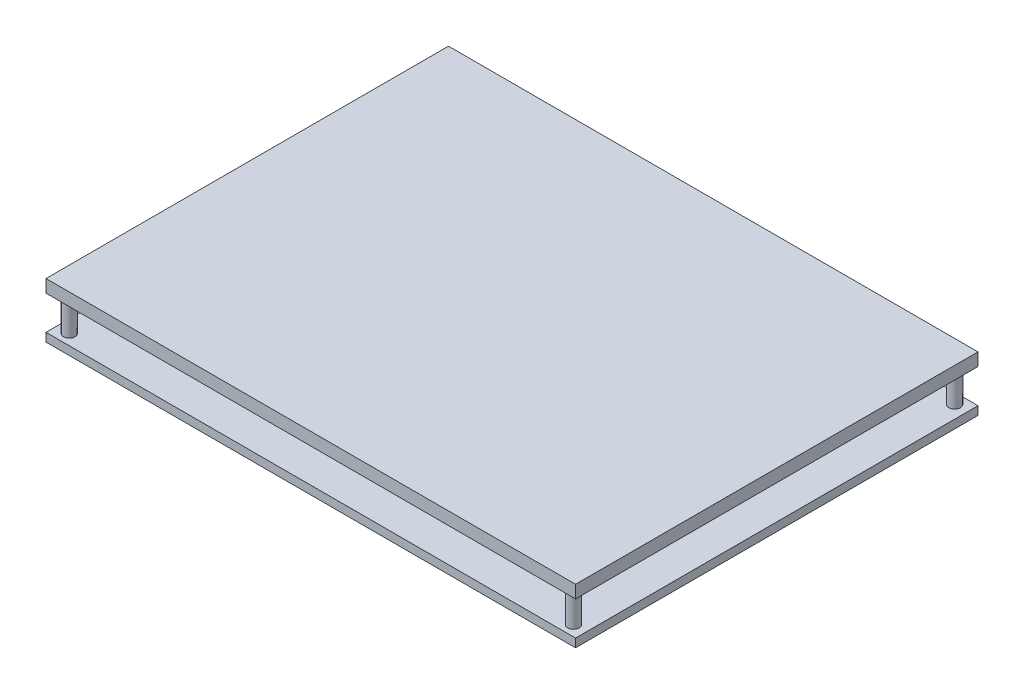
ISO-10303-21;
HEADER;
FILE_DESCRIPTION(('STEP AP214'),'2;1');
FILE_NAME('part.step','',(''),(''),'','','');
FILE_SCHEMA(('AUTOMOTIVE_DESIGN { 1 0 10303 214 1 1 1 1 }'));
ENDSEC;
DATA;
#1=APPLICATION_CONTEXT('core data for automotive mechanical design processes');
#2=APPLICATION_PROTOCOL_DEFINITION('international standard','automotive_design',2000,#1);
#3=PRODUCT_CONTEXT('',#1,'mechanical');
#4=PRODUCT('Part','Part','',(#3));
#5=PRODUCT_RELATED_PRODUCT_CATEGORY('part','',(#4));
#6=PRODUCT_DEFINITION_FORMATION('','',#4);
#7=PRODUCT_DEFINITION_CONTEXT('part definition',#1,'design');
#8=PRODUCT_DEFINITION('design','',#6,#7);
#9=PRODUCT_DEFINITION_SHAPE('','',#8);
#10=(LENGTH_UNIT() NAMED_UNIT(*) SI_UNIT(.MILLI.,.METRE.));
#11=(NAMED_UNIT(*) PLANE_ANGLE_UNIT() SI_UNIT($,.RADIAN.));
#12=(NAMED_UNIT(*) SI_UNIT($,.STERADIAN.) SOLID_ANGLE_UNIT());
#13=UNCERTAINTY_MEASURE_WITH_UNIT(LENGTH_MEASURE(1.E-05),#10,'distance_accuracy_value','');
#14=(GEOMETRIC_REPRESENTATION_CONTEXT(3) GLOBAL_UNCERTAINTY_ASSIGNED_CONTEXT((#13)) GLOBAL_UNIT_ASSIGNED_CONTEXT((#10,
#11,#12)) REPRESENTATION_CONTEXT('',''));
#15=CARTESIAN_POINT('',(0.,0.,0.));
#16=DIRECTION('',(0.,0.,1.));
#17=DIRECTION('',(1.,0.,0.));
#18=AXIS2_PLACEMENT_3D('',#15,#16,#17);
#19=CARTESIAN_POINT('',(-14.25,-8.,-33.05));
#20=DIRECTION('',(0.,-1.,0.));
#21=DIRECTION('',(0.,0.,-1.));
#22=AXIS2_PLACEMENT_3D('',#19,#20,#21);
#23=PLANE('',#22);
#24=DIRECTION('',(0.,0.,1.));
#25=VECTOR('',#24,1.);
#26=CARTESIAN_POINT('',(48.55,-8.,-25.95));
#27=LINE('',#26,#25);
#28=CARTESIAN_POINT('',(48.55,-8.,-33.05));
#29=VERTEX_POINT('',#28);
#30=CARTESIAN_POINT('',(48.55,-8.,-25.95));
#31=VERTEX_POINT('',#30);
#32=EDGE_CURVE('E126',#29,#31,#27,.T.);
#33=ORIENTED_EDGE('',*,*,#32,.T.);
#34=DIRECTION('',(-1.,0.,0.));
#35=VECTOR('',#34,1.);
#36=CARTESIAN_POINT('',(-14.25,-8.,-25.95));
#37=LINE('',#36,#35);
#38=CARTESIAN_POINT('',(-14.25,-8.,-25.95));
#39=VERTEX_POINT('',#38);
#40=EDGE_CURVE('E149',#31,#39,#37,.T.);
#41=ORIENTED_EDGE('',*,*,#40,.T.);
#42=DIRECTION('',(0.,0.,-1.));
#43=VECTOR('',#42,1.);
#44=CARTESIAN_POINT('',(-14.25,-8.,-25.95));
#45=LINE('',#44,#43);
#46=CARTESIAN_POINT('',(-14.25,-8.,-33.05));
#47=VERTEX_POINT('',#46);
#48=EDGE_CURVE('E132',#39,#47,#45,.T.);
#49=ORIENTED_EDGE('',*,*,#48,.T.);
#50=DIRECTION('',(1.,0.,0.));
#51=VECTOR('',#50,1.);
#52=CARTESIAN_POINT('',(-14.25,-8.,-33.05));
#53=LINE('',#52,#51);
#54=EDGE_CURVE('E129',#47,#29,#53,.T.);
#55=ORIENTED_EDGE('',*,*,#54,.T.);
#56=EDGE_LOOP('',(#33,#41,#49,#55));
#57=FACE_BOUND('',#56,.T.);
#58=ADVANCED_FACE('F16',(#57),#23,.T.);
#59=CARTESIAN_POINT('',(-14.25,-8.,-45.05));
#60=DIRECTION('',(0.,-1.,0.));
#61=DIRECTION('',(0.,0.,-1.));
#62=AXIS2_PLACEMENT_3D('',#59,#60,#61);
#63=PLANE('',#62);
#64=DIRECTION('',(0.,0.,1.));
#65=VECTOR('',#64,1.);
#66=CARTESIAN_POINT('',(48.55,-8.,-37.95));
#67=LINE('',#66,#65);
#68=CARTESIAN_POINT('',(48.55,-8.,-45.05));
#69=VERTEX_POINT('',#68);
#70=CARTESIAN_POINT('',(48.55,-8.,-37.95));
#71=VERTEX_POINT('',#70);
#72=EDGE_CURVE('E244',#69,#71,#67,.T.);
#73=ORIENTED_EDGE('',*,*,#72,.T.);
#74=DIRECTION('',(-1.,0.,0.));
#75=VECTOR('',#74,1.);
#76=CARTESIAN_POINT('',(-14.25,-8.,-37.95));
#77=LINE('',#76,#75);
#78=CARTESIAN_POINT('',(-14.25,-8.,-37.95));
#79=VERTEX_POINT('',#78);
#80=EDGE_CURVE('E239',#71,#79,#77,.T.);
#81=ORIENTED_EDGE('',*,*,#80,.T.);
#82=DIRECTION('',(0.,0.,-1.));
#83=VECTOR('',#82,1.);
#84=CARTESIAN_POINT('',(-14.25,-8.,-37.95));
#85=LINE('',#84,#83);
#86=CARTESIAN_POINT('',(-14.25,-8.,-45.05));
#87=VERTEX_POINT('',#86);
#88=EDGE_CURVE('E234',#79,#87,#85,.T.);
#89=ORIENTED_EDGE('',*,*,#88,.T.);
#90=DIRECTION('',(1.,0.,0.));
#91=VECTOR('',#90,1.);
#92=CARTESIAN_POINT('',(-14.25,-8.,-45.05));
#93=LINE('',#92,#91);
#94=EDGE_CURVE('E249',#87,#69,#93,.T.);
#95=ORIENTED_EDGE('',*,*,#94,.T.);
#96=EDGE_LOOP('',(#73,#81,#89,#95));
#97=FACE_BOUND('',#96,.T.);
#98=ADVANCED_FACE('F511',(#97),#63,.T.);
#99=CARTESIAN_POINT('',(-14.25,-8.,-33.05));
#100=DIRECTION('',(0.,0.,1.));
#101=DIRECTION('',(1.,0.,0.));
#102=AXIS2_PLACEMENT_3D('',#99,#100,#101);
#103=PLANE('',#102);
#104=DIRECTION('',(0.,1.,0.));
#105=VECTOR('',#104,1.);
#106=CARTESIAN_POINT('',(48.55,-8.,-33.05));
#107=LINE('',#106,#105);
#108=CARTESIAN_POINT('',(48.55,0.,-33.05));
#109=VERTEX_POINT('',#108);
#110=EDGE_CURVE('E135',#109,#29,#107,.F.);
#111=ORIENTED_EDGE('',*,*,#110,.T.);
#112=ORIENTED_EDGE('',*,*,#54,.F.);
#113=DIRECTION('',(0.,1.,0.));
#114=VECTOR('',#113,1.);
#115=CARTESIAN_POINT('',(-14.25,-8.,-33.05));
#116=LINE('',#115,#114);
#117=CARTESIAN_POINT('',(-14.25,0.,-33.05));
#118=VERTEX_POINT('',#117);
#119=EDGE_CURVE('E251',#47,#118,#116,.T.);
#120=ORIENTED_EDGE('',*,*,#119,.T.);
#121=DIRECTION('',(1.,0.,0.));
#122=VECTOR('',#121,1.);
#123=CARTESIAN_POINT('',(-62.5,0.,-33.05));
#124=LINE('',#123,#122);
#125=EDGE_CURVE('E140',#118,#109,#124,.T.);
#126=ORIENTED_EDGE('',*,*,#125,.T.);
#127=EDGE_LOOP('',(#111,#112,#120,#126));
#128=FACE_BOUND('',#127,.T.);
#129=ADVANCED_FACE('F138',(#128),#103,.F.);
#130=CARTESIAN_POINT('',(48.55,-8.,-25.95));
#131=DIRECTION('',(-1.,0.,0.));
#132=DIRECTION('',(0.,0.,1.));
#133=AXIS2_PLACEMENT_3D('',#130,#131,#132);
#134=PLANE('',#133);
#135=DIRECTION('',(0.,1.,0.));
#136=VECTOR('',#135,1.);
#137=CARTESIAN_POINT('',(48.55,-8.,-25.95));
#138=LINE('',#137,#136);
#139=CARTESIAN_POINT('',(48.55,0.,-25.95));
#140=VERTEX_POINT('',#139);
#141=EDGE_CURVE('E146',#140,#31,#138,.F.);
#142=ORIENTED_EDGE('',*,*,#141,.T.);
#143=ORIENTED_EDGE('',*,*,#32,.F.);
#144=ORIENTED_EDGE('',*,*,#110,.F.);
#145=DIRECTION('',(0.,0.,1.));
#146=VECTOR('',#145,1.);
#147=CARTESIAN_POINT('',(48.55,0.,47.5));
#148=LINE('',#147,#146);
#149=EDGE_CURVE('E229',#109,#140,#148,.T.);
#150=ORIENTED_EDGE('',*,*,#149,.T.);
#151=EDGE_LOOP('',(#142,#143,#144,#150));
#152=FACE_BOUND('',#151,.T.);
#153=ADVANCED_FACE('F144',(#152),#134,.F.);
#154=CARTESIAN_POINT('',(-14.25,-8.,-25.95));
#155=DIRECTION('',(0.,0.,-1.));
#156=DIRECTION('',(-1.,0.,0.));
#157=AXIS2_PLACEMENT_3D('',#154,#155,#156);
#158=PLANE('',#157);
#159=DIRECTION('',(0.,1.,0.));
#160=VECTOR('',#159,1.);
#161=CARTESIAN_POINT('',(-14.25,-8.,-25.95));
#162=LINE('',#161,#160);
#163=CARTESIAN_POINT('',(-14.25,0.,-25.95));
#164=VERTEX_POINT('',#163);
#165=EDGE_CURVE('E254',#164,#39,#162,.F.);
#166=ORIENTED_EDGE('',*,*,#165,.T.);
#167=ORIENTED_EDGE('',*,*,#40,.F.);
#168=ORIENTED_EDGE('',*,*,#141,.F.);
#169=DIRECTION('',(1.,0.,0.));
#170=VECTOR('',#169,1.);
#171=CARTESIAN_POINT('',(-62.5,0.,-25.95));
#172=LINE('',#171,#170);
#173=EDGE_CURVE('E227',#140,#164,#172,.F.);
#174=ORIENTED_EDGE('',*,*,#173,.T.);
#175=EDGE_LOOP('',(#166,#167,#168,#174));
#176=FACE_BOUND('',#175,.T.);
#177=ADVANCED_FACE('F258',(#176),#158,.F.);
#178=CARTESIAN_POINT('',(-14.25,-8.,-25.95));
#179=DIRECTION('',(1.,0.,0.));
#180=DIRECTION('',(0.,0.,-1.));
#181=AXIS2_PLACEMENT_3D('',#178,#179,#180);
#182=PLANE('',#181);
#183=ORIENTED_EDGE('',*,*,#119,.F.);
#184=ORIENTED_EDGE('',*,*,#48,.F.);
#185=ORIENTED_EDGE('',*,*,#165,.F.);
#186=DIRECTION('',(0.,0.,1.));
#187=VECTOR('',#186,1.);
#188=CARTESIAN_POINT('',(-14.25,0.,47.5));
#189=LINE('',#188,#187);
#190=EDGE_CURVE('E224',#164,#118,#189,.F.);
#191=ORIENTED_EDGE('',*,*,#190,.T.);
#192=EDGE_LOOP('',(#183,#184,#185,#191));
#193=FACE_BOUND('',#192,.T.);
#194=ADVANCED_FACE('F262',(#193),#182,.F.);
#195=CARTESIAN_POINT('',(-14.25,-8.,-45.05));
#196=DIRECTION('',(0.,0.,1.));
#197=DIRECTION('',(1.,0.,0.));
#198=AXIS2_PLACEMENT_3D('',#195,#196,#197);
#199=PLANE('',#198);
#200=DIRECTION('',(0.,1.,0.));
#201=VECTOR('',#200,1.);
#202=CARTESIAN_POINT('',(48.55,-8.,-45.05));
#203=LINE('',#202,#201);
#204=CARTESIAN_POINT('',(48.55,0.,-45.05));
#205=VERTEX_POINT('',#204);
#206=EDGE_CURVE('E246',#205,#69,#203,.F.);
#207=ORIENTED_EDGE('',*,*,#206,.T.);
#208=ORIENTED_EDGE('',*,*,#94,.F.);
#209=DIRECTION('',(0.,1.,0.));
#210=VECTOR('',#209,1.);
#211=CARTESIAN_POINT('',(-14.25,-8.,-45.05));
#212=LINE('',#211,#210);
#213=CARTESIAN_POINT('',(-14.25,0.,-45.05));
#214=VERTEX_POINT('',#213);
#215=EDGE_CURVE('E232',#87,#214,#212,.T.);
#216=ORIENTED_EDGE('',*,*,#215,.T.);
#217=DIRECTION('',(1.,0.,0.));
#218=VECTOR('',#217,1.);
#219=CARTESIAN_POINT('',(-62.5,0.,-45.05));
#220=LINE('',#219,#218);
#221=EDGE_CURVE('E222',#214,#205,#220,.T.);
#222=ORIENTED_EDGE('',*,*,#221,.T.);
#223=EDGE_LOOP('',(#207,#208,#216,#222));
#224=FACE_BOUND('',#223,.T.);
#225=ADVANCED_FACE('F473',(#224),#199,.F.);
#226=CARTESIAN_POINT('',(48.55,-8.,-37.95));
#227=DIRECTION('',(-1.,0.,0.));
#228=DIRECTION('',(0.,0.,1.));
#229=AXIS2_PLACEMENT_3D('',#226,#227,#228);
#230=PLANE('',#229);
#231=DIRECTION('',(0.,1.,0.));
#232=VECTOR('',#231,1.);
#233=CARTESIAN_POINT('',(48.55,-8.,-37.95));
#234=LINE('',#233,#232);
#235=CARTESIAN_POINT('',(48.55,0.,-37.95));
#236=VERTEX_POINT('',#235);
#237=EDGE_CURVE('E241',#236,#71,#234,.F.);
#238=ORIENTED_EDGE('',*,*,#237,.T.);
#239=ORIENTED_EDGE('',*,*,#72,.F.);
#240=ORIENTED_EDGE('',*,*,#206,.F.);
#241=DIRECTION('',(0.,0.,1.));
#242=VECTOR('',#241,1.);
#243=CARTESIAN_POINT('',(48.55,0.,47.5));
#244=LINE('',#243,#242);
#245=EDGE_CURVE('E220',#205,#236,#244,.T.);
#246=ORIENTED_EDGE('',*,*,#245,.T.);
#247=EDGE_LOOP('',(#238,#239,#240,#246));
#248=FACE_BOUND('',#247,.T.);
#249=ADVANCED_FACE('F464',(#248),#230,.F.);
#250=CARTESIAN_POINT('',(-14.25,-8.,-37.95));
#251=DIRECTION('',(0.,0.,-1.));
#252=DIRECTION('',(-1.,0.,0.));
#253=AXIS2_PLACEMENT_3D('',#250,#251,#252);
#254=PLANE('',#253);
#255=DIRECTION('',(0.,1.,0.));
#256=VECTOR('',#255,1.);
#257=CARTESIAN_POINT('',(-14.25,-8.,-37.95));
#258=LINE('',#257,#256);
#259=CARTESIAN_POINT('',(-14.25,0.,-37.95));
#260=VERTEX_POINT('',#259);
#261=EDGE_CURVE('E236',#260,#79,#258,.F.);
#262=ORIENTED_EDGE('',*,*,#261,.T.);
#263=ORIENTED_EDGE('',*,*,#80,.F.);
#264=ORIENTED_EDGE('',*,*,#237,.F.);
#265=DIRECTION('',(1.,0.,0.));
#266=VECTOR('',#265,1.);
#267=CARTESIAN_POINT('',(-62.5,0.,-37.95));
#268=LINE('',#267,#266);
#269=EDGE_CURVE('E218',#236,#260,#268,.F.);
#270=ORIENTED_EDGE('',*,*,#269,.T.);
#271=EDGE_LOOP('',(#262,#263,#264,#270));
#272=FACE_BOUND('',#271,.T.);
#273=ADVANCED_FACE('F278',(#272),#254,.F.);
#274=CARTESIAN_POINT('',(-14.25,-8.,-37.95));
#275=DIRECTION('',(1.,0.,0.));
#276=DIRECTION('',(0.,0.,-1.));
#277=AXIS2_PLACEMENT_3D('',#274,#275,#276);
#278=PLANE('',#277);
#279=ORIENTED_EDGE('',*,*,#215,.F.);
#280=ORIENTED_EDGE('',*,*,#88,.F.);
#281=ORIENTED_EDGE('',*,*,#261,.F.);
#282=DIRECTION('',(0.,0.,1.));
#283=VECTOR('',#282,1.);
#284=CARTESIAN_POINT('',(-14.25,0.,47.5));
#285=LINE('',#284,#283);
#286=EDGE_CURVE('E215',#260,#214,#285,.F.);
#287=ORIENTED_EDGE('',*,*,#286,.T.);
#288=EDGE_LOOP('',(#279,#280,#281,#287));
#289=FACE_BOUND('',#288,.T.);
#290=ADVANCED_FACE('F267',(#289),#278,.F.);
#291=CARTESIAN_POINT('',(-62.5,0.,47.5));
#292=DIRECTION('',(0.,1.,0.));
#293=DIRECTION('',(0.,0.,1.));
#294=AXIS2_PLACEMENT_3D('',#291,#292,#293);
#295=PLANE('',#294);
#296=ORIENTED_EDGE('',*,*,#269,.F.);
#297=ORIENTED_EDGE('',*,*,#245,.F.);
#298=ORIENTED_EDGE('',*,*,#221,.F.);
#299=ORIENTED_EDGE('',*,*,#286,.F.);
#300=EDGE_LOOP('',(#296,#297,#298,#299));
#301=FACE_BOUND('',#300,.T.);
#302=DIRECTION('',(1.,0.,0.));
#303=VECTOR('',#302,1.);
#304=CARTESIAN_POINT('',(-62.5,0.,-47.5));
#305=LINE('',#304,#303);
#306=CARTESIAN_POINT('',(-62.5,0.,-47.5));
#307=VERTEX_POINT('',#306);
#308=CARTESIAN_POINT('',(62.5,0.,-47.5));
#309=VERTEX_POINT('',#308);
#310=EDGE_CURVE('E195',#307,#309,#305,.T.);
#311=ORIENTED_EDGE('',*,*,#310,.T.);
#312=DIRECTION('',(0.,0.,1.));
#313=VECTOR('',#312,1.);
#314=CARTESIAN_POINT('',(62.5,0.,-47.5));
#315=LINE('',#314,#313);
#316=CARTESIAN_POINT('',(62.5,0.,47.5));
#317=VERTEX_POINT('',#316);
#318=EDGE_CURVE('E203',#309,#317,#315,.T.);
#319=ORIENTED_EDGE('',*,*,#318,.T.);
#320=DIRECTION('',(-1.,0.,0.));
#321=VECTOR('',#320,1.);
#322=CARTESIAN_POINT('',(-62.5,0.,47.5));
#323=LINE('',#322,#321);
#324=CARTESIAN_POINT('',(-62.5,0.,47.5));
#325=VERTEX_POINT('',#324);
#326=EDGE_CURVE('E208',#317,#325,#323,.T.);
#327=ORIENTED_EDGE('',*,*,#326,.T.);
#328=DIRECTION('',(0.,0.,-1.));
#329=VECTOR('',#328,1.);
#330=CARTESIAN_POINT('',(-62.5,0.,-47.5));
#331=LINE('',#330,#329);
#332=EDGE_CURVE('E213',#325,#307,#331,.T.);
#333=ORIENTED_EDGE('',*,*,#332,.T.);
#334=EDGE_LOOP('',(#311,#319,#327,#333));
#335=FACE_BOUND('',#334,.T.);
#336=ORIENTED_EDGE('',*,*,#173,.F.);
#337=ORIENTED_EDGE('',*,*,#149,.F.);
#338=ORIENTED_EDGE('',*,*,#125,.F.);
#339=ORIENTED_EDGE('',*,*,#190,.F.);
#340=EDGE_LOOP('',(#336,#337,#338,#339));
#341=FACE_BOUND('',#340,.T.);
#342=ADVANCED_FACE('F264',(#301,#335,#341),#295,.F.);
#343=CARTESIAN_POINT('',(-62.5,2.,-47.5));
#344=DIRECTION('',(1.,0.,0.));
#345=DIRECTION('',(0.,0.,-1.));
#346=AXIS2_PLACEMENT_3D('',#343,#344,#345);
#347=PLANE('',#346);
#348=DIRECTION('',(0.,1.,0.));
#349=VECTOR('',#348,1.);
#350=CARTESIAN_POINT('',(-62.5,2.,47.5));
#351=LINE('',#350,#349);
#352=CARTESIAN_POINT('',(-62.5,2.,47.5));
#353=VERTEX_POINT('',#352);
#354=EDGE_CURVE('E211',#325,#353,#351,.T.);
#355=ORIENTED_EDGE('',*,*,#354,.T.);
#356=DIRECTION('',(0.,0.,1.));
#357=VECTOR('',#356,1.);
#358=CARTESIAN_POINT('',(-62.5,2.,47.5));
#359=LINE('',#358,#357);
#360=CARTESIAN_POINT('',(-62.5,2.,-47.5));
#361=VERTEX_POINT('',#360);
#362=EDGE_CURVE('E193',#361,#353,#359,.T.);
#363=ORIENTED_EDGE('',*,*,#362,.F.);
#364=DIRECTION('',(0.,1.,0.));
#365=VECTOR('',#364,1.);
#366=CARTESIAN_POINT('',(-62.5,2.,-47.5));
#367=LINE('',#366,#365);
#368=EDGE_CURVE('E198',#361,#307,#367,.F.);
#369=ORIENTED_EDGE('',*,*,#368,.T.);
#370=ORIENTED_EDGE('',*,*,#332,.F.);
#371=EDGE_LOOP('',(#355,#363,#369,#370));
#372=FACE_BOUND('',#371,.T.);
#373=ADVANCED_FACE('F266',(#372),#347,.F.);
#374=CARTESIAN_POINT('',(-62.5,2.,47.5));
#375=DIRECTION('',(0.,0.,-1.));
#376=DIRECTION('',(-1.,0.,0.));
#377=AXIS2_PLACEMENT_3D('',#374,#375,#376);
#378=PLANE('',#377);
#379=DIRECTION('',(0.,1.,0.));
#380=VECTOR('',#379,1.);
#381=CARTESIAN_POINT('',(62.5,2.,47.5));
#382=LINE('',#381,#380);
#383=CARTESIAN_POINT('',(62.5,2.,47.5));
#384=VERTEX_POINT('',#383);
#385=EDGE_CURVE('E206',#317,#384,#382,.T.);
#386=ORIENTED_EDGE('',*,*,#385,.T.);
#387=DIRECTION('',(1.,0.,0.));
#388=VECTOR('',#387,1.);
#389=CARTESIAN_POINT('',(-62.5,2.,47.5));
#390=LINE('',#389,#388);
#391=EDGE_CURVE('E186',#353,#384,#390,.T.);
#392=ORIENTED_EDGE('',*,*,#391,.F.);
#393=ORIENTED_EDGE('',*,*,#354,.F.);
#394=ORIENTED_EDGE('',*,*,#326,.F.);
#395=EDGE_LOOP('',(#386,#392,#393,#394));
#396=FACE_BOUND('',#395,.T.);
#397=ADVANCED_FACE('F275',(#396),#378,.F.);
#398=CARTESIAN_POINT('',(62.5,2.,-47.5));
#399=DIRECTION('',(-1.,0.,0.));
#400=DIRECTION('',(0.,0.,1.));
#401=AXIS2_PLACEMENT_3D('',#398,#399,#400);
#402=PLANE('',#401);
#403=DIRECTION('',(0.,1.,0.));
#404=VECTOR('',#403,1.);
#405=CARTESIAN_POINT('',(62.5,2.,-47.5));
#406=LINE('',#405,#404);
#407=CARTESIAN_POINT('',(62.5,2.,-47.5));
#408=VERTEX_POINT('',#407);
#409=EDGE_CURVE('E201',#309,#408,#406,.T.);
#410=ORIENTED_EDGE('',*,*,#409,.T.);
#411=DIRECTION('',(0.,0.,1.));
#412=VECTOR('',#411,1.);
#413=CARTESIAN_POINT('',(62.5,2.,47.5));
#414=LINE('',#413,#412);
#415=EDGE_CURVE('E180',#384,#408,#414,.F.);
#416=ORIENTED_EDGE('',*,*,#415,.F.);
#417=ORIENTED_EDGE('',*,*,#385,.F.);
#418=ORIENTED_EDGE('',*,*,#318,.F.);
#419=EDGE_LOOP('',(#410,#416,#417,#418));
#420=FACE_BOUND('',#419,.T.);
#421=ADVANCED_FACE('F333',(#420),#402,.F.);
#422=CARTESIAN_POINT('',(-62.5,2.,-47.5));
#423=DIRECTION('',(0.,0.,1.));
#424=DIRECTION('',(1.,0.,0.));
#425=AXIS2_PLACEMENT_3D('',#422,#423,#424);
#426=PLANE('',#425);
#427=ORIENTED_EDGE('',*,*,#368,.F.);
#428=DIRECTION('',(1.,0.,0.));
#429=VECTOR('',#428,1.);
#430=CARTESIAN_POINT('',(-62.5,2.,-47.5));
#431=LINE('',#430,#429);
#432=EDGE_CURVE('E176',#408,#361,#431,.F.);
#433=ORIENTED_EDGE('',*,*,#432,.F.);
#434=ORIENTED_EDGE('',*,*,#409,.F.);
#435=ORIENTED_EDGE('',*,*,#310,.F.);
#436=EDGE_LOOP('',(#427,#433,#434,#435));
#437=FACE_BOUND('',#436,.T.);
#438=ADVANCED_FACE('F329',(#437),#426,.F.);
#439=CARTESIAN_POINT('',(-62.5,2.,47.5));
#440=DIRECTION('',(0.,1.,0.));
#441=DIRECTION('',(0.,0.,1.));
#442=AXIS2_PLACEMENT_3D('',#439,#440,#441);
#443=PLANE('',#442);
#444=CARTESIAN_POINT('',(59.5,2.,-45.));
#445=DIRECTION('',(0.,-1.,0.));
#446=DIRECTION('',(0.,0.,-1.));
#447=AXIS2_PLACEMENT_3D('',#444,#445,#446);
#448=CIRCLE('',#447,1.35);
#449=CARTESIAN_POINT('',(59.5,2.,-46.35));
#450=VERTEX_POINT('',#449);
#451=EDGE_CURVE('E171',#450,#450,#448,.F.);
#452=ORIENTED_EDGE('',*,*,#451,.F.);
#453=EDGE_LOOP('',(#452));
#454=FACE_BOUND('',#453,.T.);
#455=CARTESIAN_POINT('',(-59.5,2.,45.));
#456=DIRECTION('',(0.,-1.,0.));
#457=DIRECTION('',(0.,0.,-1.));
#458=AXIS2_PLACEMENT_3D('',#455,#456,#457);
#459=CIRCLE('',#458,1.35);
#460=CARTESIAN_POINT('',(-59.5,2.,43.65));
#461=VERTEX_POINT('',#460);
#462=EDGE_CURVE('E19',#461,#461,#459,.F.);
#463=ORIENTED_EDGE('',*,*,#462,.F.);
#464=EDGE_LOOP('',(#463));
#465=FACE_BOUND('',#464,.T.);
#466=ORIENTED_EDGE('',*,*,#415,.T.);
#467=ORIENTED_EDGE('',*,*,#432,.T.);
#468=ORIENTED_EDGE('',*,*,#362,.T.);
#469=ORIENTED_EDGE('',*,*,#391,.T.);
#470=EDGE_LOOP('',(#466,#467,#468,#469));
#471=FACE_BOUND('',#470,.T.);
#472=CARTESIAN_POINT('',(-59.5,2.,-45.));
#473=DIRECTION('',(0.,-1.,0.));
#474=DIRECTION('',(0.,0.,-1.));
#475=AXIS2_PLACEMENT_3D('',#472,#473,#474);
#476=CIRCLE('',#475,1.35);
#477=CARTESIAN_POINT('',(-59.5,2.,-46.35));
#478=VERTEX_POINT('',#477);
#479=EDGE_CURVE('E166',#478,#478,#476,.F.);
#480=ORIENTED_EDGE('',*,*,#479,.F.);
#481=EDGE_LOOP('',(#480));
#482=FACE_BOUND('',#481,.T.);
#483=CARTESIAN_POINT('',(59.5,2.,45.));
#484=DIRECTION('',(0.,-1.,0.));
#485=DIRECTION('',(0.,0.,-1.));
#486=AXIS2_PLACEMENT_3D('',#483,#484,#485);
#487=CIRCLE('',#486,1.35);
#488=CARTESIAN_POINT('',(59.5,2.,43.65));
#489=VERTEX_POINT('',#488);
#490=EDGE_CURVE('E169',#489,#489,#487,.F.);
#491=ORIENTED_EDGE('',*,*,#490,.F.);
#492=EDGE_LOOP('',(#491));
#493=FACE_BOUND('',#492,.T.);
#494=ADVANCED_FACE('F325',(#454,#465,#471,#482,#493),#443,.T.);
#495=CARTESIAN_POINT('',(-59.5,10.,45.));
#496=DIRECTION('',(0.,-1.,0.));
#497=DIRECTION('',(0.,0.,-1.));
#498=AXIS2_PLACEMENT_3D('',#495,#496,#497);
#499=CYLINDRICAL_SURFACE('',#498,1.35);
#500=CARTESIAN_POINT('',(-59.5,10.,45.));
#501=DIRECTION('',(0.,-1.,0.));
#502=DIRECTION('',(0.,0.,-1.));
#503=AXIS2_PLACEMENT_3D('',#500,#501,#502);
#504=CIRCLE('',#503,1.35);
#505=CARTESIAN_POINT('',(-59.5,10.,43.65));
#506=VERTEX_POINT('',#505);
#507=EDGE_CURVE('E163',#506,#506,#504,.T.);
#508=ORIENTED_EDGE('',*,*,#507,.T.);
#509=EDGE_LOOP('',(#508));
#510=FACE_BOUND('',#509,.T.);
#511=ORIENTED_EDGE('',*,*,#462,.T.);
#512=EDGE_LOOP('',(#511));
#513=FACE_BOUND('',#512,.T.);
#514=ADVANCED_FACE('F321',(#510,#513),#499,.T.);
#515=CARTESIAN_POINT('',(59.5,10.,-45.));
#516=DIRECTION('',(0.,-1.,0.));
#517=DIRECTION('',(0.,0.,-1.));
#518=AXIS2_PLACEMENT_3D('',#515,#516,#517);
#519=CYLINDRICAL_SURFACE('',#518,1.35);
#520=CARTESIAN_POINT('',(59.5,10.,-45.));
#521=DIRECTION('',(0.,-1.,0.));
#522=DIRECTION('',(0.,0.,-1.));
#523=AXIS2_PLACEMENT_3D('',#520,#521,#522);
#524=CIRCLE('',#523,1.35);
#525=CARTESIAN_POINT('',(59.5,10.,-46.35));
#526=VERTEX_POINT('',#525);
#527=EDGE_CURVE('E160',#526,#526,#524,.T.);
#528=ORIENTED_EDGE('',*,*,#527,.T.);
#529=EDGE_LOOP('',(#528));
#530=FACE_BOUND('',#529,.T.);
#531=ORIENTED_EDGE('',*,*,#451,.T.);
#532=EDGE_LOOP('',(#531));
#533=FACE_BOUND('',#532,.T.);
#534=ADVANCED_FACE('F317',(#530,#533),#519,.T.);
#535=CARTESIAN_POINT('',(59.5,10.,45.));
#536=DIRECTION('',(0.,-1.,0.));
#537=DIRECTION('',(0.,0.,-1.));
#538=AXIS2_PLACEMENT_3D('',#535,#536,#537);
#539=CYLINDRICAL_SURFACE('',#538,1.35);
#540=CARTESIAN_POINT('',(59.5,10.,45.));
#541=DIRECTION('',(0.,-1.,0.));
#542=DIRECTION('',(0.,0.,-1.));
#543=AXIS2_PLACEMENT_3D('',#540,#541,#542);
#544=CIRCLE('',#543,1.35);
#545=CARTESIAN_POINT('',(59.5,10.,43.65));
#546=VERTEX_POINT('',#545);
#547=EDGE_CURVE('E157',#546,#546,#544,.T.);
#548=ORIENTED_EDGE('',*,*,#547,.T.);
#549=EDGE_LOOP('',(#548));
#550=FACE_BOUND('',#549,.T.);
#551=ORIENTED_EDGE('',*,*,#490,.T.);
#552=EDGE_LOOP('',(#551));
#553=FACE_BOUND('',#552,.T.);
#554=ADVANCED_FACE('F313',(#550,#553),#539,.T.);
#555=CARTESIAN_POINT('',(-59.5,10.,-45.));
#556=DIRECTION('',(0.,-1.,0.));
#557=DIRECTION('',(0.,0.,-1.));
#558=AXIS2_PLACEMENT_3D('',#555,#556,#557);
#559=CYLINDRICAL_SURFACE('',#558,1.35);
#560=CARTESIAN_POINT('',(-59.5,10.,-45.));
#561=DIRECTION('',(0.,-1.,0.));
#562=DIRECTION('',(0.,0.,-1.));
#563=AXIS2_PLACEMENT_3D('',#560,#561,#562);
#564=CIRCLE('',#563,1.35);
#565=CARTESIAN_POINT('',(-59.5,10.,-46.35));
#566=VERTEX_POINT('',#565);
#567=EDGE_CURVE('E153',#566,#566,#564,.T.);
#568=ORIENTED_EDGE('',*,*,#567,.T.);
#569=EDGE_LOOP('',(#568));
#570=FACE_BOUND('',#569,.T.);
#571=ORIENTED_EDGE('',*,*,#479,.T.);
#572=EDGE_LOOP('',(#571));
#573=FACE_BOUND('',#572,.T.);
#574=ADVANCED_FACE('F309',(#570,#573),#559,.T.);
#575=CARTESIAN_POINT('',(-62.5,10.,47.5));
#576=DIRECTION('',(0.,1.,0.));
#577=DIRECTION('',(0.,0.,1.));
#578=AXIS2_PLACEMENT_3D('',#575,#576,#577);
#579=PLANE('',#578);
#580=ORIENTED_EDGE('',*,*,#567,.F.);
#581=EDGE_LOOP('',(#580));
#582=FACE_BOUND('',#581,.T.);
#583=ORIENTED_EDGE('',*,*,#547,.F.);
#584=EDGE_LOOP('',(#583));
#585=FACE_BOUND('',#584,.T.);
#586=DIRECTION('',(1.,0.,0.));
#587=VECTOR('',#586,1.);
#588=CARTESIAN_POINT('',(-62.5,10.,-47.5));
#589=LINE('',#588,#587);
#590=CARTESIAN_POINT('',(-62.5,10.,-47.5));
#591=VERTEX_POINT('',#590);
#592=CARTESIAN_POINT('',(62.5,10.,-47.5));
#593=VERTEX_POINT('',#592);
#594=EDGE_CURVE('E583',#591,#593,#589,.T.);
#595=ORIENTED_EDGE('',*,*,#594,.T.);
#596=DIRECTION('',(0.,0.,1.));
#597=VECTOR('',#596,1.);
#598=CARTESIAN_POINT('',(62.5,10.,-47.5));
#599=LINE('',#598,#597);
#600=CARTESIAN_POINT('',(62.5,10.,47.5));
#601=VERTEX_POINT('',#600);
#602=EDGE_CURVE('E585',#593,#601,#599,.T.);
#603=ORIENTED_EDGE('',*,*,#602,.T.);
#604=DIRECTION('',(-1.,0.,0.));
#605=VECTOR('',#604,1.);
#606=CARTESIAN_POINT('',(-62.5,10.,47.5));
#607=LINE('',#606,#605);
#608=CARTESIAN_POINT('',(-62.5,10.,47.5));
#609=VERTEX_POINT('',#608);
#610=EDGE_CURVE('E598',#601,#609,#607,.T.);
#611=ORIENTED_EDGE('',*,*,#610,.T.);
#612=DIRECTION('',(0.,0.,-1.));
#613=VECTOR('',#612,1.);
#614=CARTESIAN_POINT('',(-62.5,10.,-47.5));
#615=LINE('',#614,#613);
#616=EDGE_CURVE('E156',#609,#591,#615,.T.);
#617=ORIENTED_EDGE('',*,*,#616,.T.);
#618=EDGE_LOOP('',(#595,#603,#611,#617));
#619=FACE_BOUND('',#618,.T.);
#620=ORIENTED_EDGE('',*,*,#527,.F.);
#621=EDGE_LOOP('',(#620));
#622=FACE_BOUND('',#621,.T.);
#623=ORIENTED_EDGE('',*,*,#507,.F.);
#624=EDGE_LOOP('',(#623));
#625=FACE_BOUND('',#624,.T.);
#626=ADVANCED_FACE('F305',(#582,#585,#619,#622,#625),#579,.F.);
#627=CARTESIAN_POINT('',(-62.5,13.,-47.5));
#628=DIRECTION('',(1.,0.,0.));
#629=DIRECTION('',(0.,0.,-1.));
#630=AXIS2_PLACEMENT_3D('',#627,#628,#629);
#631=PLANE('',#630);
#632=DIRECTION('',(0.,1.,0.));
#633=VECTOR('',#632,1.);
#634=CARTESIAN_POINT('',(-62.5,13.,47.5));
#635=LINE('',#634,#633);
#636=CARTESIAN_POINT('',(-62.5,13.,47.5));
#637=VERTEX_POINT('',#636);
#638=EDGE_CURVE('E599',#609,#637,#635,.T.);
#639=ORIENTED_EDGE('',*,*,#638,.T.);
#640=DIRECTION('',(0.,0.,1.));
#641=VECTOR('',#640,1.);
#642=CARTESIAN_POINT('',(-62.5,13.,47.5));
#643=LINE('',#642,#641);
#644=CARTESIAN_POINT('',(-62.5,13.,-47.5));
#645=VERTEX_POINT('',#644);
#646=EDGE_CURVE('E589',#645,#637,#643,.T.);
#647=ORIENTED_EDGE('',*,*,#646,.F.);
#648=DIRECTION('',(0.,1.,0.));
#649=VECTOR('',#648,1.);
#650=CARTESIAN_POINT('',(-62.5,13.,-47.5));
#651=LINE('',#650,#649);
#652=EDGE_CURVE('E590',#645,#591,#651,.F.);
#653=ORIENTED_EDGE('',*,*,#652,.T.);
#654=ORIENTED_EDGE('',*,*,#616,.F.);
#655=EDGE_LOOP('',(#639,#647,#653,#654));
#656=FACE_BOUND('',#655,.T.);
#657=ADVANCED_FACE('F301',(#656),#631,.F.);
#658=CARTESIAN_POINT('',(-62.5,13.,47.5));
#659=DIRECTION('',(0.,0.,-1.));
#660=DIRECTION('',(-1.,0.,0.));
#661=AXIS2_PLACEMENT_3D('',#658,#659,#660);
#662=PLANE('',#661);
#663=DIRECTION('',(0.,1.,0.));
#664=VECTOR('',#663,1.);
#665=CARTESIAN_POINT('',(62.5,13.,47.5));
#666=LINE('',#665,#664);
#667=CARTESIAN_POINT('',(62.5,13.,47.5));
#668=VERTEX_POINT('',#667);
#669=EDGE_CURVE('E594',#601,#668,#666,.T.);
#670=ORIENTED_EDGE('',*,*,#669,.T.);
#671=DIRECTION('',(1.,0.,0.));
#672=VECTOR('',#671,1.);
#673=CARTESIAN_POINT('',(-62.5,13.,47.5));
#674=LINE('',#673,#672);
#675=EDGE_CURVE('E604',#637,#668,#674,.T.);
#676=ORIENTED_EDGE('',*,*,#675,.F.);
#677=ORIENTED_EDGE('',*,*,#638,.F.);
#678=ORIENTED_EDGE('',*,*,#610,.F.);
#679=EDGE_LOOP('',(#670,#676,#677,#678));
#680=FACE_BOUND('',#679,.T.);
#681=ADVANCED_FACE('F298',(#680),#662,.F.);
#682=CARTESIAN_POINT('',(62.5,13.,-47.5));
#683=DIRECTION('',(-1.,0.,0.));
#684=DIRECTION('',(0.,0.,1.));
#685=AXIS2_PLACEMENT_3D('',#682,#683,#684);
#686=PLANE('',#685);
#687=DIRECTION('',(0.,1.,0.));
#688=VECTOR('',#687,1.);
#689=CARTESIAN_POINT('',(62.5,13.,-47.5));
#690=LINE('',#689,#688);
#691=CARTESIAN_POINT('',(62.5,13.,-47.5));
#692=VERTEX_POINT('',#691);
#693=EDGE_CURVE('E34',#593,#692,#690,.T.);
#694=ORIENTED_EDGE('',*,*,#693,.T.);
#695=DIRECTION('',(0.,0.,1.));
#696=VECTOR('',#695,1.);
#697=CARTESIAN_POINT('',(62.5,13.,47.5));
#698=LINE('',#697,#696);
#699=EDGE_CURVE('E25',#668,#692,#698,.F.);
#700=ORIENTED_EDGE('',*,*,#699,.F.);
#701=ORIENTED_EDGE('',*,*,#669,.F.);
#702=ORIENTED_EDGE('',*,*,#602,.F.);
#703=EDGE_LOOP('',(#694,#700,#701,#702));
#704=FACE_BOUND('',#703,.T.);
#705=ADVANCED_FACE('F291',(#704),#686,.F.);
#706=CARTESIAN_POINT('',(-62.5,13.,-47.5));
#707=DIRECTION('',(0.,0.,1.));
#708=DIRECTION('',(1.,0.,0.));
#709=AXIS2_PLACEMENT_3D('',#706,#707,#708);
#710=PLANE('',#709);
#711=ORIENTED_EDGE('',*,*,#652,.F.);
#712=DIRECTION('',(1.,0.,0.));
#713=VECTOR('',#712,1.);
#714=CARTESIAN_POINT('',(-62.5,13.,-47.5));
#715=LINE('',#714,#713);
#716=EDGE_CURVE('E11',#692,#645,#715,.F.);
#717=ORIENTED_EDGE('',*,*,#716,.F.);
#718=ORIENTED_EDGE('',*,*,#693,.F.);
#719=ORIENTED_EDGE('',*,*,#594,.F.);
#720=EDGE_LOOP('',(#711,#717,#718,#719));
#721=FACE_BOUND('',#720,.T.);
#722=ADVANCED_FACE('F285',(#721),#710,.F.);
#723=CARTESIAN_POINT('',(-62.5,13.,47.5));
#724=DIRECTION('',(0.,1.,0.));
#725=DIRECTION('',(0.,0.,1.));
#726=AXIS2_PLACEMENT_3D('',#723,#724,#725);
#727=PLANE('',#726);
#728=ORIENTED_EDGE('',*,*,#699,.T.);
#729=ORIENTED_EDGE('',*,*,#716,.T.);
#730=ORIENTED_EDGE('',*,*,#646,.T.);
#731=ORIENTED_EDGE('',*,*,#675,.T.);
#732=EDGE_LOOP('',(#728,#729,#730,#731));
#733=FACE_BOUND('',#732,.T.);
#734=ADVANCED_FACE('F283',(#733),#727,.T.);
#735=CLOSED_SHELL('',(#58,#98,#129,#153,#177,#194,#225,#249,#273,#290,#342,#373,#397,#421,#438,
#494,#514,#534,#554,#574,#626,#657,#681,#705,#722,#734));
#736=MANIFOLD_SOLID_BREP('B1',#735);
#737=ADVANCED_BREP_SHAPE_REPRESENTATION('',(#18,#736),#14);
#738=SHAPE_DEFINITION_REPRESENTATION(#9,#737);
ENDSEC;
END-ISO-10303-21;
